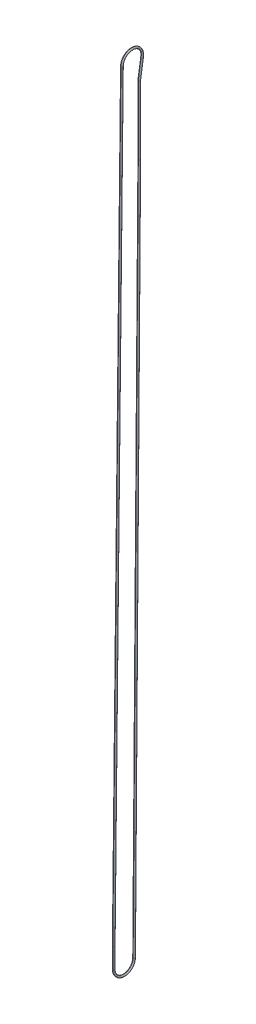
ISO-10303-21;
HEADER;
FILE_DESCRIPTION(('STEP AP214'),'2;1');
FILE_NAME('part.step','',(''),(''),'','','');
FILE_SCHEMA(('AUTOMOTIVE_DESIGN { 1 0 10303 214 1 1 1 1 }'));
ENDSEC;
DATA;
#1=APPLICATION_CONTEXT('core data for automotive mechanical design processes');
#2=APPLICATION_PROTOCOL_DEFINITION('international standard','automotive_design',2000,#1);
#3=PRODUCT_CONTEXT('',#1,'mechanical');
#4=PRODUCT('Part','Part','',(#3));
#5=PRODUCT_RELATED_PRODUCT_CATEGORY('part','',(#4));
#6=PRODUCT_DEFINITION_FORMATION('','',#4);
#7=PRODUCT_DEFINITION_CONTEXT('part definition',#1,'design');
#8=PRODUCT_DEFINITION('design','',#6,#7);
#9=PRODUCT_DEFINITION_SHAPE('','',#8);
#10=(LENGTH_UNIT() NAMED_UNIT(*) SI_UNIT(.MILLI.,.METRE.));
#11=(NAMED_UNIT(*) PLANE_ANGLE_UNIT() SI_UNIT($,.RADIAN.));
#12=(NAMED_UNIT(*) SI_UNIT($,.STERADIAN.) SOLID_ANGLE_UNIT());
#13=UNCERTAINTY_MEASURE_WITH_UNIT(LENGTH_MEASURE(1.E-05),#10,'distance_accuracy_value','');
#14=(GEOMETRIC_REPRESENTATION_CONTEXT(3) GLOBAL_UNCERTAINTY_ASSIGNED_CONTEXT((#13)) GLOBAL_UNIT_ASSIGNED_CONTEXT((#10,
#11,#12)) REPRESENTATION_CONTEXT('',''));
#15=CARTESIAN_POINT('',(0.,0.,0.));
#16=DIRECTION('',(0.,0.,1.));
#17=DIRECTION('',(1.,0.,0.));
#18=AXIS2_PLACEMENT_3D('',#15,#16,#17);
#19=CARTESIAN_POINT('',(0.,1174.97552149225,-23.8125));
#20=DIRECTION('',(0.,-1.,0.));
#21=DIRECTION('',(0.,0.,-1.));
#22=AXIS2_PLACEMENT_3D('',#19,#20,#21);
#23=CYLINDRICAL_SURFACE('',#22,1.5);
#24=DIRECTION('',(0.,-1.,0.));
#25=VECTOR('',#24,1.);
#26=CARTESIAN_POINT('',(0.,1174.97552149225,-22.3125));
#27=LINE('',#26,#25);
#28=CARTESIAN_POINT('',(0.,1174.8641104475,-22.3125));
#29=VERTEX_POINT('',#28);
#30=CARTESIAN_POINT('',(0.,1068.39313301823,-22.3125211542278));
#31=VERTEX_POINT('',#30);
#32=EDGE_CURVE('E108',#29,#31,#27,.T.);
#33=ORIENTED_EDGE('',*,*,#32,.F.);
#34=CARTESIAN_POINT('',(0.,1174.6358895525,-25.3125));
#35=CARTESIAN_POINT('',(-3.,1174.63588955249,-25.3125));
#36=CARTESIAN_POINT('',(-3.,1174.8641104475,-22.3125));
#37=CARTESIAN_POINT('',(0.,1174.8641104475,-22.3125));
#38=(BOUNDED_CURVE() B_SPLINE_CURVE(3,(#34,#35,#36,#37),.UNSPECIFIED.,.F.,
.F.) B_SPLINE_CURVE_WITH_KNOTS((4,4),(3.1415926535898,6.28318530717959),
.UNSPECIFIED.) CURVE() GEOMETRIC_REPRESENTATION_ITEM() RATIONAL_B_SPLINE_CURVE((1.,
0.333333333333334,0.333333333333334,1.)) REPRESENTATION_ITEM(''));
#39=CARTESIAN_POINT('',(0.,1174.6358895525,-25.3125));
#40=VERTEX_POINT('',#39);
#41=EDGE_CURVE('E104',#40,#29,#38,.T.);
#42=ORIENTED_EDGE('',*,*,#41,.F.);
#43=DIRECTION('',(0.,-1.,0.));
#44=VECTOR('',#43,1.);
#45=CARTESIAN_POINT('',(0.,1174.97552149225,-25.3125));
#46=LINE('',#45,#44);
#47=CARTESIAN_POINT('',(0.,1068.37848713905,-25.3124830764982));
#48=VERTEX_POINT('',#47);
#49=EDGE_CURVE('E106',#40,#48,#46,.T.);
#50=ORIENTED_EDGE('',*,*,#49,.T.);
#51=CARTESIAN_POINT('',(0.,1068.3875,-23.8125));
#52=DIRECTION('',(0.,-0.999971794362766,0.00751069097419215));
#53=DIRECTION('',(0.,0.00751069097419214,0.999971794362766));
#54=AXIS2_PLACEMENT_3D('',#51,#52,#53);
#55=CIRCLE('',#54,1.5);
#56=EDGE_CURVE('E11',#31,#48,#55,.T.);
#57=ORIENTED_EDGE('',*,*,#56,.F.);
#58=EDGE_LOOP('',(#33,#42,#50,#57));
#59=FACE_BOUND('',#58,.T.);
#60=ADVANCED_FACE('F16',(#59),#23,.T.);
#61=CARTESIAN_POINT('',(0.,1068.3875,-23.8125));
#62=DIRECTION('',(0.,-0.999971794362766,0.00751069097419215));
#63=DIRECTION('',(0.,-0.00751069097419215,-0.999971794362766));
#64=AXIS2_PLACEMENT_3D('',#61,#62,#63);
#65=CYLINDRICAL_SURFACE('',#64,1.5);
#66=DIRECTION('',(0.,-0.999971794362766,0.00751069097426095));
#67=VECTOR('',#66,1.);
#68=CARTESIAN_POINT('',(0.,1068.39876603646,-22.3125423084558));
#69=LINE('',#68,#67);
#70=CARTESIAN_POINT('',(0.,-0.107308997294414,-14.287097011958));
#71=VERTEX_POINT('',#70);
#72=EDGE_CURVE('E181',#31,#71,#69,.T.);
#73=ORIENTED_EDGE('',*,*,#72,.F.);
#74=ORIENTED_EDGE('',*,*,#56,.T.);
#75=DIRECTION('',(0.,-0.999971794362766,0.00751069097426095));
#76=VECTOR('',#75,1.);
#77=CARTESIAN_POINT('',(0.,1068.37623396354,-25.312457691544));
#78=LINE('',#77,#76);
#79=CARTESIAN_POINT('',(0.,-0.129841070217435,-17.2870123950463));
#80=VERTEX_POINT('',#79);
#81=EDGE_CURVE('E172',#48,#80,#78,.T.);
#82=ORIENTED_EDGE('',*,*,#81,.T.);
#83=CARTESIAN_POINT('',(0.,-0.118575033756147,-15.7870547035022));
#84=DIRECTION('',(0.,-0.999971794362766,0.00751069097426109));
#85=DIRECTION('',(0.,-0.00751069097426109,-0.999971794362766));
#86=AXIS2_PLACEMENT_3D('',#83,#84,#85);
#87=CIRCLE('',#86,1.5);
#88=EDGE_CURVE('E153',#71,#80,#87,.T.);
#89=ORIENTED_EDGE('',*,*,#88,.F.);
#90=EDGE_LOOP('',(#73,#74,#82,#89));
#91=FACE_BOUND('',#90,.T.);
#92=ADVANCED_FACE('F192',(#91),#65,.T.);
#93=CARTESIAN_POINT('',(0.,0.,0.));
#94=DIRECTION('',(-1.,0.,0.));
#95=DIRECTION('',(0.,0.,1.));
#96=AXIS2_PLACEMENT_3D('',#93,#94,#95);
#97=TOROIDAL_SURFACE('',#96,15.7875,1.5);
#98=CARTESIAN_POINT('',(0.,0.,0.));
#99=DIRECTION('',(-1.,0.,0.));
#100=DIRECTION('',(0.,0.,1.));
#101=AXIS2_PLACEMENT_3D('',#98,#99,#100);
#102=CIRCLE('',#101,17.2875);
#103=CARTESIAN_POINT('',(0.,0.,17.2875));
#104=VERTEX_POINT('',#103);
#105=EDGE_CURVE('E165',#80,#104,#102,.T.);
#106=ORIENTED_EDGE('',*,*,#105,.F.);
#107=CARTESIAN_POINT('',(0.,-0.118575033756147,-15.7870547035022));
#108=DIRECTION('',(0.,-0.999971794362766,0.00751069097426109));
#109=DIRECTION('',(0.,-0.00751069097426109,-0.999971794362766));
#110=AXIS2_PLACEMENT_3D('',#107,#108,#109);
#111=CIRCLE('',#110,1.5);
#112=EDGE_CURVE('E65',#80,#71,#111,.T.);
#113=ORIENTED_EDGE('',*,*,#112,.T.);
#114=CARTESIAN_POINT('',(0.,0.,0.));
#115=DIRECTION('',(-1.,0.,0.));
#116=DIRECTION('',(0.,0.,1.));
#117=AXIS2_PLACEMENT_3D('',#114,#115,#116);
#118=CIRCLE('',#117,14.2875);
#119=CARTESIAN_POINT('',(0.,0.,14.2875));
#120=VERTEX_POINT('',#119);
#121=EDGE_CURVE('E471',#71,#120,#118,.T.);
#122=ORIENTED_EDGE('',*,*,#121,.T.);
#123=CARTESIAN_POINT('',(0.,0.,15.7875));
#124=DIRECTION('',(0.,1.,0.));
#125=DIRECTION('',(0.,0.,1.));
#126=AXIS2_PLACEMENT_3D('',#123,#124,#125);
#127=CIRCLE('',#126,1.5);
#128=EDGE_CURVE('E154',#104,#120,#127,.T.);
#129=ORIENTED_EDGE('',*,*,#128,.F.);
#130=EDGE_LOOP('',(#106,#113,#122,#129));
#131=FACE_BOUND('',#130,.T.);
#132=ADVANCED_FACE('F18',(#131),#97,.T.);
#133=CARTESIAN_POINT('',(0.,0.,15.7875));
#134=DIRECTION('',(0.,1.,0.));
#135=DIRECTION('',(0.,0.,1.));
#136=AXIS2_PLACEMENT_3D('',#133,#134,#135);
#137=CYLINDRICAL_SURFACE('',#136,1.5);
#138=DIRECTION('',(0.,1.,0.));
#139=VECTOR('',#138,1.);
#140=CARTESIAN_POINT('',(0.,0.,14.2875));
#141=LINE('',#140,#139);
#142=CARTESIAN_POINT('',(0.,31.7370286324029,14.2875350544359));
#143=VERTEX_POINT('',#142);
#144=EDGE_CURVE('E158',#120,#143,#141,.T.);
#145=ORIENTED_EDGE('',*,*,#144,.F.);
#146=CARTESIAN_POINT('',(0.,0.,15.7875));
#147=DIRECTION('',(0.,1.,0.));
#148=DIRECTION('',(0.,0.,1.));
#149=AXIS2_PLACEMENT_3D('',#146,#147,#148);
#150=CIRCLE('',#149,1.5);
#151=EDGE_CURVE('E168',#120,#104,#150,.T.);
#152=ORIENTED_EDGE('',*,*,#151,.T.);
#153=DIRECTION('',(0.,1.,0.));
#154=VECTOR('',#153,1.);
#155=CARTESIAN_POINT('',(0.,0.,17.2875));
#156=LINE('',#155,#154);
#157=CARTESIAN_POINT('',(0.,31.7581070455428,17.2874561825951));
#158=VERTEX_POINT('',#157);
#159=EDGE_CURVE('E268',#104,#158,#156,.T.);
#160=ORIENTED_EDGE('',*,*,#159,.T.);
#161=CARTESIAN_POINT('',(0.,31.7499999999995,15.7875));
#162=DIRECTION('',(0.,0.999941576793421,-0.0108093940573752));
#163=DIRECTION('',(0.,-0.0108093940573752,-0.999941576793421));
#164=AXIS2_PLACEMENT_3D('',#161,#162,#163);
#165=CIRCLE('',#164,1.5);
#166=EDGE_CURVE('E29',#143,#158,#165,.T.);
#167=ORIENTED_EDGE('',*,*,#166,.F.);
#168=EDGE_LOOP('',(#145,#152,#160,#167));
#169=FACE_BOUND('',#168,.T.);
#170=ADVANCED_FACE('F239',(#169),#137,.T.);
#171=CARTESIAN_POINT('',(0.,31.7499999999995,15.7875));
#172=DIRECTION('',(0.,0.999941576793421,-0.0108093940573752));
#173=DIRECTION('',(0.,0.0108093940573752,0.999941576793421));
#174=AXIS2_PLACEMENT_3D('',#171,#172,#173);
#175=CYLINDRICAL_SURFACE('',#174,1.5);
#176=DIRECTION('',(0.,0.999941576793421,-0.010809394057376));
#177=VECTOR('',#176,1.);
#178=CARTESIAN_POINT('',(0.,31.7337859089135,14.2875876348099));
#179=LINE('',#178,#177);
#180=CARTESIAN_POINT('',(0.,1206.65443921759,1.58666527843617));
#181=VERTEX_POINT('',#180);
#182=EDGE_CURVE('E293',#143,#181,#179,.T.);
#183=ORIENTED_EDGE('',*,*,#182,.F.);
#184=ORIENTED_EDGE('',*,*,#166,.T.);
#185=DIRECTION('',(0.,0.999941576793421,-0.010809394057376));
#186=VECTOR('',#185,1.);
#187=CARTESIAN_POINT('',(0.,31.7662140910856,17.2874123651901));
#188=LINE('',#187,#186);
#189=CARTESIAN_POINT('',(0.,1206.68686739977,4.58649000881642));
#190=VERTEX_POINT('',#189);
#191=EDGE_CURVE('E159',#158,#190,#188,.T.);
#192=ORIENTED_EDGE('',*,*,#191,.T.);
#193=CARTESIAN_POINT('',(0.,1206.67065330868,3.0865776436263));
#194=DIRECTION('',(0.,0.999941576793421,-0.0108093940573243));
#195=DIRECTION('',(0.,0.0108093940573243,0.999941576793421));
#196=AXIS2_PLACEMENT_3D('',#193,#194,#195);
#197=CIRCLE('',#196,1.5);
#198=EDGE_CURVE('E160',#181,#190,#197,.T.);
#199=ORIENTED_EDGE('',*,*,#198,.F.);
#200=EDGE_LOOP('',(#183,#184,#192,#199));
#201=FACE_BOUND('',#200,.T.);
#202=ADVANCED_FACE('F243',(#201),#175,.T.);
#203=CARTESIAN_POINT('',(0.,1206.5,-12.6999999999999));
#204=DIRECTION('',(-1.,0.,0.));
#205=DIRECTION('',(0.,0.,1.));
#206=AXIS2_PLACEMENT_3D('',#203,#204,#205);
#207=TOROIDAL_SURFACE('',#206,15.7875,1.5);
#208=CARTESIAN_POINT('',(0.,1206.5,-12.6999999999999));
#209=DIRECTION('',(-1.,0.,0.));
#210=DIRECTION('',(0.,0.,1.));
#211=AXIS2_PLACEMENT_3D('',#208,#209,#210);
#212=CIRCLE('',#211,17.2875);
#213=CARTESIAN_POINT('',(0.,1203.88488835245,-29.7885589597495));
#214=VERTEX_POINT('',#213);
#215=EDGE_CURVE('E164',#190,#214,#212,.T.);
#216=ORIENTED_EDGE('',*,*,#215,.F.);
#217=CARTESIAN_POINT('',(0.,1206.67065330868,3.0865776436263));
#218=DIRECTION('',(0.,0.999941576793421,-0.0108093940573243));
#219=DIRECTION('',(0.,0.0108093940573243,0.999941576793421));
#220=AXIS2_PLACEMENT_3D('',#217,#218,#219);
#221=CIRCLE('',#220,1.5);
#222=EDGE_CURVE('E288',#190,#181,#221,.T.);
#223=ORIENTED_EDGE('',*,*,#222,.T.);
#224=CARTESIAN_POINT('',(0.,1206.5,-12.6999999999999));
#225=DIRECTION('',(-1.,0.,0.));
#226=DIRECTION('',(0.,0.,1.));
#227=AXIS2_PLACEMENT_3D('',#224,#225,#226);
#228=CIRCLE('',#227,14.2875);
#229=CARTESIAN_POINT('',(0.,1204.33870382274,-26.8230823506823));
#230=VERTEX_POINT('',#229);
#231=EDGE_CURVE('E146',#181,#230,#228,.T.);
#232=ORIENTED_EDGE('',*,*,#231,.T.);
#233=CARTESIAN_POINT('',(0.,1204.11179608759,-28.3058206552159));
#234=DIRECTION('',(0.,-0.988492203022387,0.151271823430369));
#235=DIRECTION('',(0.,-0.151271823430369,-0.988492203022387));
#236=AXIS2_PLACEMENT_3D('',#233,#234,#235);
#237=CIRCLE('',#236,1.5);
#238=EDGE_CURVE('E140',#214,#230,#237,.T.);
#239=ORIENTED_EDGE('',*,*,#238,.F.);
#240=EDGE_LOOP('',(#216,#223,#232,#239));
#241=FACE_BOUND('',#240,.T.);
#242=ADVANCED_FACE('F311',(#241),#207,.T.);
#243=CARTESIAN_POINT('',(0.,1204.11179608759,-28.3058206552159));
#244=DIRECTION('',(0.,-0.988492203022387,0.151271823430369));
#245=DIRECTION('',(0.,-0.151271823430369,-0.988492203022387));
#246=AXIS2_PLACEMENT_3D('',#243,#244,#245);
#247=CYLINDRICAL_SURFACE('',#246,1.5);
#248=DIRECTION('',(0.,-0.988492203022389,0.151271823430353));
#249=VECTOR('',#248,1.);
#250=CARTESIAN_POINT('',(0.,1204.33870382274,-26.8230823506823));
#251=LINE('',#250,#249);
#252=EDGE_CURVE('E81',#230,#29,#251,.T.);
#253=ORIENTED_EDGE('',*,*,#252,.F.);
#254=CARTESIAN_POINT('',(0.,1204.11179608759,-28.3058206552159));
#255=DIRECTION('',(0.,-0.988492203022387,0.151271823430369));
#256=DIRECTION('',(0.,-0.151271823430369,-0.988492203022387));
#257=AXIS2_PLACEMENT_3D('',#254,#255,#256);
#258=CIRCLE('',#257,1.5);
#259=EDGE_CURVE('E126',#230,#214,#258,.T.);
#260=ORIENTED_EDGE('',*,*,#259,.T.);
#261=DIRECTION('',(0.,-0.988492203022389,0.151271823430353));
#262=VECTOR('',#261,1.);
#263=CARTESIAN_POINT('',(0.,1203.88488835245,-29.7885589597495));
#264=LINE('',#263,#262);
#265=EDGE_CURVE('E123',#214,#40,#264,.T.);
#266=ORIENTED_EDGE('',*,*,#265,.T.);
#267=ORIENTED_EDGE('',*,*,#41,.T.);
#268=EDGE_LOOP('',(#253,#260,#266,#267));
#269=FACE_BOUND('',#268,.T.);
#270=ADVANCED_FACE('F124',(#269),#247,.T.);
#271=CARTESIAN_POINT('',(0.,1174.97552149225,-23.8125));
#272=DIRECTION('',(0.,-1.,0.));
#273=DIRECTION('',(0.,0.,-1.));
#274=AXIS2_PLACEMENT_3D('',#271,#272,#273);
#275=CYLINDRICAL_SURFACE('',#274,1.5);
#276=CARTESIAN_POINT('',(0.,1174.8641104475,-22.3125));
#277=CARTESIAN_POINT('',(3.,1174.8641104475,-22.3125));
#278=CARTESIAN_POINT('',(3.,1174.63588955249,-25.3125));
#279=CARTESIAN_POINT('',(0.,1174.6358895525,-25.3125));
#280=(BOUNDED_CURVE() B_SPLINE_CURVE(3,(#276,#277,#278,#279),.UNSPECIFIED.,.F.,
.F.) B_SPLINE_CURVE_WITH_KNOTS((4,4),(0.,3.1415926535898),
.UNSPECIFIED.) CURVE() GEOMETRIC_REPRESENTATION_ITEM() RATIONAL_B_SPLINE_CURVE((1.,
0.333333333333334,0.333333333333334,1.)) REPRESENTATION_ITEM(''));
#281=EDGE_CURVE('E117',#29,#40,#280,.T.);
#282=ORIENTED_EDGE('',*,*,#281,.F.);
#283=ORIENTED_EDGE('',*,*,#32,.T.);
#284=CARTESIAN_POINT('',(0.,1068.3875,-23.8125));
#285=DIRECTION('',(0.,-0.999971794362766,0.00751069097419215));
#286=DIRECTION('',(0.,-0.00751069097419214,-0.999971794362766));
#287=AXIS2_PLACEMENT_3D('',#284,#285,#286);
#288=CIRCLE('',#287,1.5);
#289=EDGE_CURVE('E119',#48,#31,#288,.T.);
#290=ORIENTED_EDGE('',*,*,#289,.F.);
#291=ORIENTED_EDGE('',*,*,#49,.F.);
#292=EDGE_LOOP('',(#282,#283,#290,#291));
#293=FACE_BOUND('',#292,.T.);
#294=ADVANCED_FACE('F115',(#293),#275,.T.);
#295=CARTESIAN_POINT('',(0.,1068.3875,-23.8125));
#296=DIRECTION('',(0.,-0.999971794362766,0.00751069097419215));
#297=DIRECTION('',(0.,-0.00751069097419215,-0.999971794362766));
#298=AXIS2_PLACEMENT_3D('',#295,#296,#297);
#299=CYLINDRICAL_SURFACE('',#298,1.5);
#300=ORIENTED_EDGE('',*,*,#289,.T.);
#301=ORIENTED_EDGE('',*,*,#72,.T.);
#302=ORIENTED_EDGE('',*,*,#112,.F.);
#303=ORIENTED_EDGE('',*,*,#81,.F.);
#304=EDGE_LOOP('',(#300,#301,#302,#303));
#305=FACE_BOUND('',#304,.T.);
#306=ADVANCED_FACE('F204',(#305),#299,.T.);
#307=CARTESIAN_POINT('',(0.,0.,15.7875));
#308=DIRECTION('',(0.,1.,0.));
#309=DIRECTION('',(0.,0.,1.));
#310=AXIS2_PLACEMENT_3D('',#307,#308,#309);
#311=CYLINDRICAL_SURFACE('',#310,1.5);
#312=ORIENTED_EDGE('',*,*,#128,.T.);
#313=ORIENTED_EDGE('',*,*,#144,.T.);
#314=CARTESIAN_POINT('',(0.,31.7499999999995,15.7875));
#315=DIRECTION('',(0.,0.999941576793421,-0.0108093940573752));
#316=DIRECTION('',(0.,0.0108093940573752,0.999941576793421));
#317=AXIS2_PLACEMENT_3D('',#314,#315,#316);
#318=CIRCLE('',#317,1.5);
#319=EDGE_CURVE('E131',#158,#143,#318,.T.);
#320=ORIENTED_EDGE('',*,*,#319,.F.);
#321=ORIENTED_EDGE('',*,*,#159,.F.);
#322=EDGE_LOOP('',(#312,#313,#320,#321));
#323=FACE_BOUND('',#322,.T.);
#324=ADVANCED_FACE('F236',(#323),#311,.T.);
#325=CARTESIAN_POINT('',(0.,31.7499999999995,15.7875));
#326=DIRECTION('',(0.,0.999941576793421,-0.0108093940573752));
#327=DIRECTION('',(0.,0.0108093940573752,0.999941576793421));
#328=AXIS2_PLACEMENT_3D('',#325,#326,#327);
#329=CYLINDRICAL_SURFACE('',#328,1.5);
#330=ORIENTED_EDGE('',*,*,#319,.T.);
#331=ORIENTED_EDGE('',*,*,#182,.T.);
#332=ORIENTED_EDGE('',*,*,#222,.F.);
#333=ORIENTED_EDGE('',*,*,#191,.F.);
#334=EDGE_LOOP('',(#330,#331,#332,#333));
#335=FACE_BOUND('',#334,.T.);
#336=ADVANCED_FACE('F226',(#335),#329,.T.);
#337=CARTESIAN_POINT('',(0.,1204.11179608759,-28.3058206552159));
#338=DIRECTION('',(0.,-0.988492203022387,0.151271823430369));
#339=DIRECTION('',(0.,-0.151271823430369,-0.988492203022387));
#340=AXIS2_PLACEMENT_3D('',#337,#338,#339);
#341=CYLINDRICAL_SURFACE('',#340,1.5);
#342=ORIENTED_EDGE('',*,*,#238,.T.);
#343=ORIENTED_EDGE('',*,*,#252,.T.);
#344=ORIENTED_EDGE('',*,*,#281,.T.);
#345=ORIENTED_EDGE('',*,*,#265,.F.);
#346=EDGE_LOOP('',(#342,#343,#344,#345));
#347=FACE_BOUND('',#346,.T.);
#348=ADVANCED_FACE('F133',(#347),#341,.T.);
#349=CARTESIAN_POINT('',(0.,0.,0.));
#350=DIRECTION('',(-1.,0.,0.));
#351=DIRECTION('',(0.,0.,1.));
#352=AXIS2_PLACEMENT_3D('',#349,#350,#351);
#353=TOROIDAL_SURFACE('',#352,15.7875,1.5);
#354=ORIENTED_EDGE('',*,*,#88,.T.);
#355=ORIENTED_EDGE('',*,*,#105,.T.);
#356=ORIENTED_EDGE('',*,*,#151,.F.);
#357=ORIENTED_EDGE('',*,*,#121,.F.);
#358=EDGE_LOOP('',(#354,#355,#356,#357));
#359=FACE_BOUND('',#358,.T.);
#360=ADVANCED_FACE('F317',(#359),#353,.T.);
#361=CARTESIAN_POINT('',(0.,1206.5,-12.6999999999999));
#362=DIRECTION('',(-1.,0.,0.));
#363=DIRECTION('',(0.,0.,1.));
#364=AXIS2_PLACEMENT_3D('',#361,#362,#363);
#365=TOROIDAL_SURFACE('',#364,15.7875,1.5);
#366=ORIENTED_EDGE('',*,*,#198,.T.);
#367=ORIENTED_EDGE('',*,*,#215,.T.);
#368=ORIENTED_EDGE('',*,*,#259,.F.);
#369=ORIENTED_EDGE('',*,*,#231,.F.);
#370=EDGE_LOOP('',(#366,#367,#368,#369));
#371=FACE_BOUND('',#370,.T.);
#372=ADVANCED_FACE('F237',(#371),#365,.T.);
#373=CLOSED_SHELL('',(#60,#92,#132,#170,#202,#242,#270,#294,#306,#324,#336,#348,#360,#372));
#374=MANIFOLD_SOLID_BREP('B1',#373);
#375=ADVANCED_BREP_SHAPE_REPRESENTATION('',(#18,#374),#14);
#376=SHAPE_DEFINITION_REPRESENTATION(#9,#375);
ENDSEC;
END-ISO-10303-21;
